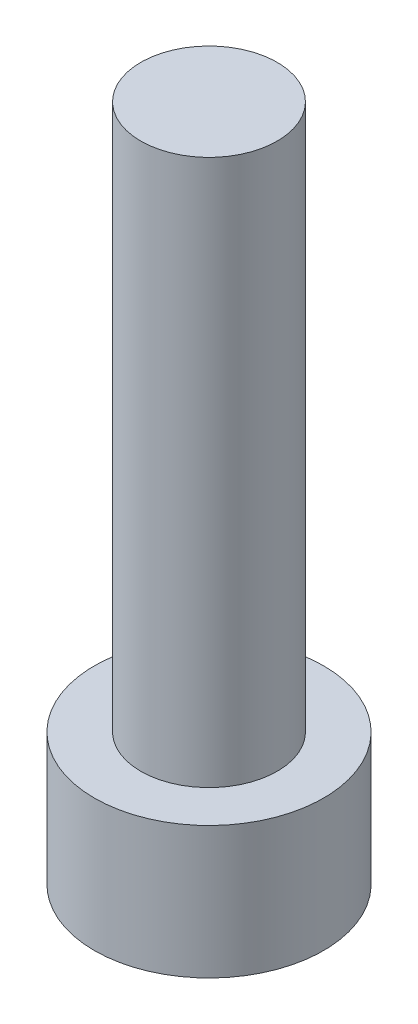
ISO-10303-21;
HEADER;
FILE_DESCRIPTION(('STEP AP214'),'2;1');
FILE_NAME('part.step','',(''),(''),'','','');
FILE_SCHEMA(('AUTOMOTIVE_DESIGN { 1 0 10303 214 1 1 1 1 }'));
ENDSEC;
DATA;
#1=APPLICATION_CONTEXT('core data for automotive mechanical design processes');
#2=APPLICATION_PROTOCOL_DEFINITION('international standard','automotive_design',2000,#1);
#3=PRODUCT_CONTEXT('',#1,'mechanical');
#4=PRODUCT('Part','Part','',(#3));
#5=PRODUCT_RELATED_PRODUCT_CATEGORY('part','',(#4));
#6=PRODUCT_DEFINITION_FORMATION('','',#4);
#7=PRODUCT_DEFINITION_CONTEXT('part definition',#1,'design');
#8=PRODUCT_DEFINITION('design','',#6,#7);
#9=PRODUCT_DEFINITION_SHAPE('','',#8);
#10=(LENGTH_UNIT() NAMED_UNIT(*) SI_UNIT(.MILLI.,.METRE.));
#11=(NAMED_UNIT(*) PLANE_ANGLE_UNIT() SI_UNIT($,.RADIAN.));
#12=(NAMED_UNIT(*) SI_UNIT($,.STERADIAN.) SOLID_ANGLE_UNIT());
#13=UNCERTAINTY_MEASURE_WITH_UNIT(LENGTH_MEASURE(1.E-05),#10,'distance_accuracy_value','');
#14=(GEOMETRIC_REPRESENTATION_CONTEXT(3) GLOBAL_UNCERTAINTY_ASSIGNED_CONTEXT((#13)) GLOBAL_UNIT_ASSIGNED_CONTEXT((#10,
#11,#12)) REPRESENTATION_CONTEXT('',''));
#15=CARTESIAN_POINT('',(0.,0.,0.));
#16=DIRECTION('',(0.,0.,1.));
#17=DIRECTION('',(1.,0.,0.));
#18=AXIS2_PLACEMENT_3D('',#15,#16,#17);
#19=CARTESIAN_POINT('',(0.,4.84,0.));
#20=DIRECTION('',(0.,-1.,0.));
#21=DIRECTION('',(0.,0.,-1.));
#22=AXIS2_PLACEMENT_3D('',#19,#20,#21);
#23=CYLINDRICAL_SURFACE('',#22,4.2);
#24=CARTESIAN_POINT('',(0.,4.84,0.));
#25=DIRECTION('',(0.,1.,0.));
#26=DIRECTION('',(0.,0.,1.));
#27=AXIS2_PLACEMENT_3D('',#24,#25,#26);
#28=CIRCLE('',#27,4.2);
#29=CARTESIAN_POINT('',(0.,4.84,4.2));
#30=VERTEX_POINT('',#29);
#31=EDGE_CURVE('E43',#30,#30,#28,.T.);
#32=ORIENTED_EDGE('',*,*,#31,.F.);
#33=EDGE_LOOP('',(#32));
#34=FACE_BOUND('',#33,.T.);
#35=CARTESIAN_POINT('',(0.,0.,0.));
#36=DIRECTION('',(0.,1.,0.));
#37=DIRECTION('',(0.,0.,1.));
#38=AXIS2_PLACEMENT_3D('',#35,#36,#37);
#39=CIRCLE('',#38,4.2);
#40=CARTESIAN_POINT('',(0.,0.,4.2));
#41=VERTEX_POINT('',#40);
#42=EDGE_CURVE('E38',#41,#41,#39,.T.);
#43=ORIENTED_EDGE('',*,*,#42,.T.);
#44=EDGE_LOOP('',(#43));
#45=FACE_BOUND('',#44,.T.);
#46=ADVANCED_FACE('F35',(#34,#45),#23,.T.);
#47=CARTESIAN_POINT('',(0.,4.84,0.));
#48=DIRECTION('',(0.,1.,0.));
#49=DIRECTION('',(0.,0.,1.));
#50=AXIS2_PLACEMENT_3D('',#47,#48,#49);
#51=PLANE('',#50);
#52=CARTESIAN_POINT('',(0.,4.84,0.));
#53=DIRECTION('',(0.,1.,0.));
#54=DIRECTION('',(0.,0.,1.));
#55=AXIS2_PLACEMENT_3D('',#52,#53,#54);
#56=CIRCLE('',#55,2.5);
#57=CARTESIAN_POINT('',(0.,4.84,2.5));
#58=VERTEX_POINT('',#57);
#59=EDGE_CURVE('E11',#58,#58,#56,.T.);
#60=ORIENTED_EDGE('',*,*,#59,.F.);
#61=EDGE_LOOP('',(#60));
#62=FACE_BOUND('',#61,.T.);
#63=ORIENTED_EDGE('',*,*,#31,.T.);
#64=EDGE_LOOP('',(#63));
#65=FACE_BOUND('',#64,.T.);
#66=ADVANCED_FACE('F155',(#62,#65),#51,.T.);
#67=CARTESIAN_POINT('',(0.,0.,0.));
#68=DIRECTION('',(0.,1.,0.));
#69=DIRECTION('',(0.,0.,1.));
#70=AXIS2_PLACEMENT_3D('',#67,#68,#69);
#71=PLANE('',#70);
#72=DIRECTION('',(-0.5,0.,0.866025403784439));
#73=VECTOR('',#72,1.);
#74=CARTESIAN_POINT('',(2.3,0.,0.));
#75=LINE('',#74,#73);
#76=CARTESIAN_POINT('',(2.3,0.,0.));
#77=VERTEX_POINT('',#76);
#78=CARTESIAN_POINT('',(1.15,0.,1.99185842870421));
#79=VERTEX_POINT('',#78);
#80=EDGE_CURVE('E125',#77,#79,#75,.T.);
#81=ORIENTED_EDGE('',*,*,#80,.F.);
#82=DIRECTION('',(0.5,0.,0.866025403784439));
#83=VECTOR('',#82,1.);
#84=CARTESIAN_POINT('',(1.15,0.,-1.99185842870421));
#85=LINE('',#84,#83);
#86=CARTESIAN_POINT('',(1.15,0.,-1.99185842870421));
#87=VERTEX_POINT('',#86);
#88=EDGE_CURVE('E51',#87,#77,#85,.T.);
#89=ORIENTED_EDGE('',*,*,#88,.F.);
#90=DIRECTION('',(1.,0.,0.));
#91=VECTOR('',#90,1.);
#92=CARTESIAN_POINT('',(-1.15,0.,-1.99185842870421));
#93=LINE('',#92,#91);
#94=CARTESIAN_POINT('',(-1.15,0.,-1.99185842870421));
#95=VERTEX_POINT('',#94);
#96=EDGE_CURVE('E134',#95,#87,#93,.T.);
#97=ORIENTED_EDGE('',*,*,#96,.F.);
#98=DIRECTION('',(0.5,0.,-0.866025403784439));
#99=VECTOR('',#98,1.);
#100=CARTESIAN_POINT('',(-2.3,0.,0.));
#101=LINE('',#100,#99);
#102=CARTESIAN_POINT('',(-2.3,0.,0.));
#103=VERTEX_POINT('',#102);
#104=EDGE_CURVE('E132',#103,#95,#101,.T.);
#105=ORIENTED_EDGE('',*,*,#104,.F.);
#106=DIRECTION('',(-0.5,0.,-0.866025403784439));
#107=VECTOR('',#106,1.);
#108=CARTESIAN_POINT('',(-1.15,0.,1.99185842870421));
#109=LINE('',#108,#107);
#110=CARTESIAN_POINT('',(-1.15,0.,1.99185842870421));
#111=VERTEX_POINT('',#110);
#112=EDGE_CURVE('E99',#111,#103,#109,.T.);
#113=ORIENTED_EDGE('',*,*,#112,.F.);
#114=DIRECTION('',(-1.,0.,0.));
#115=VECTOR('',#114,1.);
#116=CARTESIAN_POINT('',(1.15,0.,1.99185842870421));
#117=LINE('',#116,#115);
#118=EDGE_CURVE('E128',#79,#111,#117,.T.);
#119=ORIENTED_EDGE('',*,*,#118,.F.);
#120=EDGE_LOOP('',(#81,#89,#97,#105,#113,#119));
#121=FACE_BOUND('',#120,.T.);
#122=ORIENTED_EDGE('',*,*,#42,.F.);
#123=EDGE_LOOP('',(#122));
#124=FACE_BOUND('',#123,.T.);
#125=ADVANCED_FACE('F152',(#121,#124),#71,.F.);
#126=CARTESIAN_POINT('',(0.,24.84,0.));
#127=DIRECTION('',(0.,-1.,0.));
#128=DIRECTION('',(0.,0.,-1.));
#129=AXIS2_PLACEMENT_3D('',#126,#127,#128);
#130=CYLINDRICAL_SURFACE('',#129,2.5);
#131=CARTESIAN_POINT('',(0.,24.84,0.));
#132=DIRECTION('',(0.,1.,0.));
#133=DIRECTION('',(0.,0.,1.));
#134=AXIS2_PLACEMENT_3D('',#131,#132,#133);
#135=CIRCLE('',#134,2.5);
#136=CARTESIAN_POINT('',(0.,24.84,2.5));
#137=VERTEX_POINT('',#136);
#138=EDGE_CURVE('E138',#137,#137,#135,.T.);
#139=ORIENTED_EDGE('',*,*,#138,.F.);
#140=EDGE_LOOP('',(#139));
#141=FACE_BOUND('',#140,.T.);
#142=ORIENTED_EDGE('',*,*,#59,.T.);
#143=EDGE_LOOP('',(#142));
#144=FACE_BOUND('',#143,.T.);
#145=ADVANCED_FACE('F154',(#141,#144),#130,.T.);
#146=CARTESIAN_POINT('',(0.,24.84,0.));
#147=DIRECTION('',(0.,1.,0.));
#148=DIRECTION('',(0.,0.,1.));
#149=AXIS2_PLACEMENT_3D('',#146,#147,#148);
#150=PLANE('',#149);
#151=ORIENTED_EDGE('',*,*,#138,.T.);
#152=EDGE_LOOP('',(#151));
#153=FACE_BOUND('',#152,.T.);
#154=ADVANCED_FACE('F161',(#153),#150,.T.);
#155=CARTESIAN_POINT('',(1.15,3.4,-1.99185842870421));
#156=DIRECTION('',(0.866025403784439,0.,-0.5));
#157=DIRECTION('',(-0.5,0.,-0.866025403784439));
#158=AXIS2_PLACEMENT_3D('',#155,#156,#157);
#159=PLANE('',#158);
#160=ORIENTED_EDGE('',*,*,#88,.T.);
#161=DIRECTION('',(0.,-1.,0.));
#162=VECTOR('',#161,1.);
#163=CARTESIAN_POINT('',(2.3,3.4,0.));
#164=LINE('',#163,#162);
#165=CARTESIAN_POINT('',(2.3,3.4,0.));
#166=VERTEX_POINT('',#165);
#167=EDGE_CURVE('E81',#166,#77,#164,.T.);
#168=ORIENTED_EDGE('',*,*,#167,.F.);
#169=DIRECTION('',(0.5,0.,0.866025403784439));
#170=VECTOR('',#169,1.);
#171=CARTESIAN_POINT('',(1.15,3.4,-1.99185842870421));
#172=LINE('',#171,#170);
#173=CARTESIAN_POINT('',(1.15,3.4,-1.99185842870421));
#174=VERTEX_POINT('',#173);
#175=EDGE_CURVE('E136',#174,#166,#172,.T.);
#176=ORIENTED_EDGE('',*,*,#175,.F.);
#177=DIRECTION('',(0.,-1.,0.));
#178=VECTOR('',#177,1.);
#179=CARTESIAN_POINT('',(1.15,3.4,-1.99185842870421));
#180=LINE('',#179,#178);
#181=EDGE_CURVE('E59',#174,#87,#180,.T.);
#182=ORIENTED_EDGE('',*,*,#181,.T.);
#183=EDGE_LOOP('',(#160,#168,#176,#182));
#184=FACE_BOUND('',#183,.T.);
#185=ADVANCED_FACE('F190',(#184),#159,.F.);
#186=CARTESIAN_POINT('',(-1.15,3.4,-1.99185842870421));
#187=DIRECTION('',(0.,0.,-1.));
#188=DIRECTION('',(-1.,0.,0.));
#189=AXIS2_PLACEMENT_3D('',#186,#187,#188);
#190=PLANE('',#189);
#191=ORIENTED_EDGE('',*,*,#96,.T.);
#192=ORIENTED_EDGE('',*,*,#181,.F.);
#193=DIRECTION('',(1.,0.,0.));
#194=VECTOR('',#193,1.);
#195=CARTESIAN_POINT('',(-1.15,3.4,-1.99185842870421));
#196=LINE('',#195,#194);
#197=CARTESIAN_POINT('',(-1.15,3.4,-1.99185842870421));
#198=VERTEX_POINT('',#197);
#199=EDGE_CURVE('E111',#198,#174,#196,.T.);
#200=ORIENTED_EDGE('',*,*,#199,.F.);
#201=DIRECTION('',(0.,-1.,0.));
#202=VECTOR('',#201,1.);
#203=CARTESIAN_POINT('',(-1.15,3.4,-1.99185842870421));
#204=LINE('',#203,#202);
#205=EDGE_CURVE('E103',#198,#95,#204,.T.);
#206=ORIENTED_EDGE('',*,*,#205,.T.);
#207=EDGE_LOOP('',(#191,#192,#200,#206));
#208=FACE_BOUND('',#207,.T.);
#209=ADVANCED_FACE('F204',(#208),#190,.F.);
#210=CARTESIAN_POINT('',(-2.3,3.4,0.));
#211=DIRECTION('',(-0.866025403784439,0.,-0.5));
#212=DIRECTION('',(-0.5,0.,0.866025403784439));
#213=AXIS2_PLACEMENT_3D('',#210,#211,#212);
#214=PLANE('',#213);
#215=ORIENTED_EDGE('',*,*,#104,.T.);
#216=ORIENTED_EDGE('',*,*,#205,.F.);
#217=DIRECTION('',(0.5,0.,-0.866025403784439));
#218=VECTOR('',#217,1.);
#219=CARTESIAN_POINT('',(-2.3,3.4,0.));
#220=LINE('',#219,#218);
#221=CARTESIAN_POINT('',(-2.3,3.4,0.));
#222=VERTEX_POINT('',#221);
#223=EDGE_CURVE('E107',#222,#198,#220,.T.);
#224=ORIENTED_EDGE('',*,*,#223,.F.);
#225=DIRECTION('',(0.,-1.,0.));
#226=VECTOR('',#225,1.);
#227=CARTESIAN_POINT('',(-2.3,3.4,0.));
#228=LINE('',#227,#226);
#229=EDGE_CURVE('E92',#222,#103,#228,.T.);
#230=ORIENTED_EDGE('',*,*,#229,.T.);
#231=EDGE_LOOP('',(#215,#216,#224,#230));
#232=FACE_BOUND('',#231,.T.);
#233=ADVANCED_FACE('F108',(#232),#214,.F.);
#234=CARTESIAN_POINT('',(-1.15,3.4,1.99185842870421));
#235=DIRECTION('',(-0.866025403784439,0.,0.5));
#236=DIRECTION('',(0.5,0.,0.866025403784439));
#237=AXIS2_PLACEMENT_3D('',#234,#235,#236);
#238=PLANE('',#237);
#239=ORIENTED_EDGE('',*,*,#112,.T.);
#240=ORIENTED_EDGE('',*,*,#229,.F.);
#241=DIRECTION('',(-0.5,0.,-0.866025403784439));
#242=VECTOR('',#241,1.);
#243=CARTESIAN_POINT('',(-1.15,3.4,1.99185842870421));
#244=LINE('',#243,#242);
#245=CARTESIAN_POINT('',(-1.15,3.4,1.99185842870421));
#246=VERTEX_POINT('',#245);
#247=EDGE_CURVE('E96',#246,#222,#244,.T.);
#248=ORIENTED_EDGE('',*,*,#247,.F.);
#249=DIRECTION('',(0.,-1.,0.));
#250=VECTOR('',#249,1.);
#251=CARTESIAN_POINT('',(-1.15,3.4,1.99185842870421));
#252=LINE('',#251,#250);
#253=EDGE_CURVE('E104',#246,#111,#252,.T.);
#254=ORIENTED_EDGE('',*,*,#253,.T.);
#255=EDGE_LOOP('',(#239,#240,#248,#254));
#256=FACE_BOUND('',#255,.T.);
#257=ADVANCED_FACE('F94',(#256),#238,.F.);
#258=CARTESIAN_POINT('',(1.15,3.4,1.99185842870421));
#259=DIRECTION('',(0.,0.,1.));
#260=DIRECTION('',(1.,0.,0.));
#261=AXIS2_PLACEMENT_3D('',#258,#259,#260);
#262=PLANE('',#261);
#263=ORIENTED_EDGE('',*,*,#118,.T.);
#264=ORIENTED_EDGE('',*,*,#253,.F.);
#265=DIRECTION('',(-1.,0.,0.));
#266=VECTOR('',#265,1.);
#267=CARTESIAN_POINT('',(1.15,3.4,1.99185842870421));
#268=LINE('',#267,#266);
#269=CARTESIAN_POINT('',(1.15,3.4,1.99185842870421));
#270=VERTEX_POINT('',#269);
#271=EDGE_CURVE('E117',#270,#246,#268,.T.);
#272=ORIENTED_EDGE('',*,*,#271,.F.);
#273=DIRECTION('',(0.,-1.,0.));
#274=VECTOR('',#273,1.);
#275=CARTESIAN_POINT('',(1.15,3.4,1.99185842870421));
#276=LINE('',#275,#274);
#277=EDGE_CURVE('E141',#270,#79,#276,.T.);
#278=ORIENTED_EDGE('',*,*,#277,.T.);
#279=EDGE_LOOP('',(#263,#264,#272,#278));
#280=FACE_BOUND('',#279,.T.);
#281=ADVANCED_FACE('F229',(#280),#262,.F.);
#282=CARTESIAN_POINT('',(2.3,3.4,0.));
#283=DIRECTION('',(0.866025403784439,0.,0.5));
#284=DIRECTION('',(0.5,0.,-0.866025403784439));
#285=AXIS2_PLACEMENT_3D('',#282,#283,#284);
#286=PLANE('',#285);
#287=ORIENTED_EDGE('',*,*,#80,.T.);
#288=ORIENTED_EDGE('',*,*,#277,.F.);
#289=DIRECTION('',(-0.5,0.,0.866025403784439));
#290=VECTOR('',#289,1.);
#291=CARTESIAN_POINT('',(2.3,3.4,0.));
#292=LINE('',#291,#290);
#293=EDGE_CURVE('E119',#166,#270,#292,.T.);
#294=ORIENTED_EDGE('',*,*,#293,.F.);
#295=ORIENTED_EDGE('',*,*,#167,.T.);
#296=EDGE_LOOP('',(#287,#288,#294,#295));
#297=FACE_BOUND('',#296,.T.);
#298=ADVANCED_FACE('F238',(#297),#286,.F.);
#299=CARTESIAN_POINT('',(0.,3.4,0.));
#300=DIRECTION('',(0.,-1.,0.));
#301=DIRECTION('',(0.,0.,-1.));
#302=AXIS2_PLACEMENT_3D('',#299,#300,#301);
#303=PLANE('',#302);
#304=ORIENTED_EDGE('',*,*,#175,.T.);
#305=ORIENTED_EDGE('',*,*,#293,.T.);
#306=ORIENTED_EDGE('',*,*,#271,.T.);
#307=ORIENTED_EDGE('',*,*,#247,.T.);
#308=ORIENTED_EDGE('',*,*,#223,.T.);
#309=ORIENTED_EDGE('',*,*,#199,.T.);
#310=EDGE_LOOP('',(#304,#305,#306,#307,#308,#309));
#311=FACE_BOUND('',#310,.T.);
#312=ADVANCED_FACE('F114',(#311),#303,.T.);
#313=CLOSED_SHELL('',(#46,#66,#125,#145,#154,#185,#209,#233,#257,#281,#298,#312));
#314=MANIFOLD_SOLID_BREP('B2',#313);
#315=ADVANCED_BREP_SHAPE_REPRESENTATION('',(#18,#314),#14);
#316=SHAPE_DEFINITION_REPRESENTATION(#9,#315);
ENDSEC;
END-ISO-10303-21;
